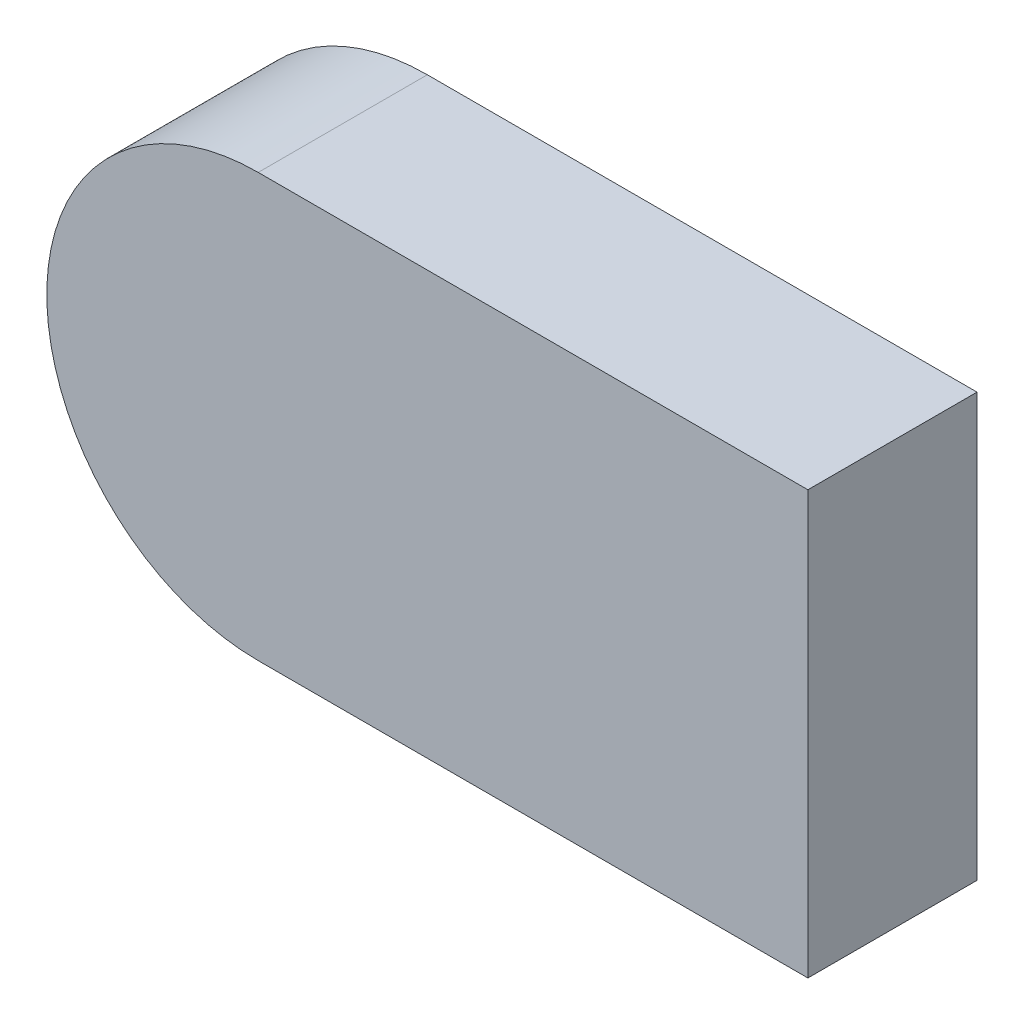
ISO-10303-21;
HEADER;
FILE_DESCRIPTION(('STEP AP214'),'2;1');
FILE_NAME('part.step','',(''),(''),'','','');
FILE_SCHEMA(('AUTOMOTIVE_DESIGN { 1 0 10303 214 1 1 1 1 }'));
ENDSEC;
DATA;
#1=APPLICATION_CONTEXT('core data for automotive mechanical design processes');
#2=APPLICATION_PROTOCOL_DEFINITION('international standard','automotive_design',2000,#1);
#3=PRODUCT_CONTEXT('',#1,'mechanical');
#4=PRODUCT('Part','Part','',(#3));
#5=PRODUCT_RELATED_PRODUCT_CATEGORY('part','',(#4));
#6=PRODUCT_DEFINITION_FORMATION('','',#4);
#7=PRODUCT_DEFINITION_CONTEXT('part definition',#1,'design');
#8=PRODUCT_DEFINITION('design','',#6,#7);
#9=PRODUCT_DEFINITION_SHAPE('','',#8);
#10=(LENGTH_UNIT() NAMED_UNIT(*) SI_UNIT(.MILLI.,.METRE.));
#11=(NAMED_UNIT(*) PLANE_ANGLE_UNIT() SI_UNIT($,.RADIAN.));
#12=(NAMED_UNIT(*) SI_UNIT($,.STERADIAN.) SOLID_ANGLE_UNIT());
#13=UNCERTAINTY_MEASURE_WITH_UNIT(LENGTH_MEASURE(1.E-05),#10,'distance_accuracy_value','');
#14=(GEOMETRIC_REPRESENTATION_CONTEXT(3) GLOBAL_UNCERTAINTY_ASSIGNED_CONTEXT((#13)) GLOBAL_UNIT_ASSIGNED_CONTEXT((#10,
#11,#12)) REPRESENTATION_CONTEXT('',''));
#15=CARTESIAN_POINT('',(0.,0.,0.));
#16=DIRECTION('',(0.,0.,1.));
#17=DIRECTION('',(1.,0.,0.));
#18=AXIS2_PLACEMENT_3D('',#15,#16,#17);
#19=CARTESIAN_POINT('',(2.05,0.125,0.));
#20=DIRECTION('',(0.,-1.,0.));
#21=DIRECTION('',(-1.,0.,0.));
#22=AXIS2_PLACEMENT_3D('',#19,#20,#21);
#23=PLANE('',#22);
#24=DIRECTION('',(0.,0.,1.));
#25=VECTOR('',#24,1.);
#26=CARTESIAN_POINT('',(2.05,0.125,0.));
#27=LINE('',#26,#25);
#28=CARTESIAN_POINT('',(2.05,0.125,0.));
#29=VERTEX_POINT('',#28);
#30=CARTESIAN_POINT('',(2.05,0.125,0.1));
#31=VERTEX_POINT('',#30);
#32=EDGE_CURVE('E11',#29,#31,#27,.T.);
#33=ORIENTED_EDGE('',*,*,#32,.T.);
#34=DIRECTION('',(-1.,0.,0.));
#35=VECTOR('',#34,1.);
#36=CARTESIAN_POINT('',(2.05,0.125,0.1));
#37=LINE('',#36,#35);
#38=CARTESIAN_POINT('',(1.725,0.125,0.1));
#39=VERTEX_POINT('',#38);
#40=EDGE_CURVE('E24',#31,#39,#37,.T.);
#41=ORIENTED_EDGE('',*,*,#40,.T.);
#42=DIRECTION('',(0.,0.,1.));
#43=VECTOR('',#42,1.);
#44=CARTESIAN_POINT('',(1.725,0.125,0.));
#45=LINE('',#44,#43);
#46=CARTESIAN_POINT('',(1.725,0.125,0.));
#47=VERTEX_POINT('',#46);
#48=EDGE_CURVE('E86',#47,#39,#45,.T.);
#49=ORIENTED_EDGE('',*,*,#48,.F.);
#50=DIRECTION('',(-1.,0.,0.));
#51=VECTOR('',#50,1.);
#52=CARTESIAN_POINT('',(2.05,0.125,0.));
#53=LINE('',#52,#51);
#54=EDGE_CURVE('E83',#29,#47,#53,.T.);
#55=ORIENTED_EDGE('',*,*,#54,.F.);
#56=EDGE_LOOP('',(#33,#41,#49,#55));
#57=FACE_BOUND('',#56,.T.);
#58=ADVANCED_FACE('F17',(#57),#23,.T.);
#59=CARTESIAN_POINT('',(1.725,0.25,0.));
#60=DIRECTION('',(0.,0.,-1.));
#61=DIRECTION('',(1.,0.,0.));
#62=AXIS2_PLACEMENT_3D('',#59,#60,#61);
#63=CYLINDRICAL_SURFACE('',#62,0.125);
#64=CARTESIAN_POINT('',(1.725,0.25,0.));
#65=DIRECTION('',(0.,0.,1.));
#66=DIRECTION('',(1.,0.,0.));
#67=AXIS2_PLACEMENT_3D('',#64,#65,#66);
#68=CIRCLE('',#67,0.125);
#69=CARTESIAN_POINT('',(1.725,0.375,0.));
#70=VERTEX_POINT('',#69);
#71=EDGE_CURVE('E80',#70,#47,#68,.T.);
#72=ORIENTED_EDGE('',*,*,#71,.T.);
#73=ORIENTED_EDGE('',*,*,#48,.T.);
#74=CARTESIAN_POINT('',(1.725,0.25,0.1));
#75=DIRECTION('',(0.,0.,1.));
#76=DIRECTION('',(1.,0.,0.));
#77=AXIS2_PLACEMENT_3D('',#74,#75,#76);
#78=CIRCLE('',#77,0.125);
#79=CARTESIAN_POINT('',(1.725,0.375,0.1));
#80=VERTEX_POINT('',#79);
#81=EDGE_CURVE('E78',#80,#39,#78,.T.);
#82=ORIENTED_EDGE('',*,*,#81,.F.);
#83=DIRECTION('',(0.,0.,1.));
#84=VECTOR('',#83,1.);
#85=CARTESIAN_POINT('',(1.725,0.375,0.));
#86=LINE('',#85,#84);
#87=EDGE_CURVE('E67',#70,#80,#86,.T.);
#88=ORIENTED_EDGE('',*,*,#87,.F.);
#89=EDGE_LOOP('',(#72,#73,#82,#88));
#90=FACE_BOUND('',#89,.T.);
#91=ADVANCED_FACE('F89',(#90),#63,.T.);
#92=CARTESIAN_POINT('',(2.05,0.375,0.));
#93=DIRECTION('',(0.,-1.,0.));
#94=DIRECTION('',(-1.,0.,0.));
#95=AXIS2_PLACEMENT_3D('',#92,#93,#94);
#96=PLANE('',#95);
#97=DIRECTION('',(-1.,0.,0.));
#98=VECTOR('',#97,1.);
#99=CARTESIAN_POINT('',(2.05,0.375,0.));
#100=LINE('',#99,#98);
#101=CARTESIAN_POINT('',(2.05,0.375,0.));
#102=VERTEX_POINT('',#101);
#103=EDGE_CURVE('E70',#102,#70,#100,.T.);
#104=ORIENTED_EDGE('',*,*,#103,.T.);
#105=ORIENTED_EDGE('',*,*,#87,.T.);
#106=DIRECTION('',(-1.,0.,0.));
#107=VECTOR('',#106,1.);
#108=CARTESIAN_POINT('',(2.05,0.375,0.1));
#109=LINE('',#108,#107);
#110=CARTESIAN_POINT('',(2.05,0.375,0.1));
#111=VERTEX_POINT('',#110);
#112=EDGE_CURVE('E61',#111,#80,#109,.T.);
#113=ORIENTED_EDGE('',*,*,#112,.F.);
#114=DIRECTION('',(0.,0.,1.));
#115=VECTOR('',#114,1.);
#116=CARTESIAN_POINT('',(2.05,0.375,0.));
#117=LINE('',#116,#115);
#118=EDGE_CURVE('E51',#102,#111,#117,.T.);
#119=ORIENTED_EDGE('',*,*,#118,.F.);
#120=EDGE_LOOP('',(#104,#105,#113,#119));
#121=FACE_BOUND('',#120,.T.);
#122=ADVANCED_FACE('F65',(#121),#96,.F.);
#123=CARTESIAN_POINT('',(2.05,0.125,0.));
#124=DIRECTION('',(-1.,0.,0.));
#125=DIRECTION('',(0.,1.,0.));
#126=AXIS2_PLACEMENT_3D('',#123,#124,#125);
#127=PLANE('',#126);
#128=DIRECTION('',(0.,1.,0.));
#129=VECTOR('',#128,1.);
#130=CARTESIAN_POINT('',(2.05,0.125,0.));
#131=LINE('',#130,#129);
#132=EDGE_CURVE('E57',#29,#102,#131,.T.);
#133=ORIENTED_EDGE('',*,*,#132,.T.);
#134=ORIENTED_EDGE('',*,*,#118,.T.);
#135=DIRECTION('',(0.,1.,0.));
#136=VECTOR('',#135,1.);
#137=CARTESIAN_POINT('',(2.05,0.125,0.1));
#138=LINE('',#137,#136);
#139=EDGE_CURVE('E55',#31,#111,#138,.T.);
#140=ORIENTED_EDGE('',*,*,#139,.F.);
#141=ORIENTED_EDGE('',*,*,#32,.F.);
#142=EDGE_LOOP('',(#133,#134,#140,#141));
#143=FACE_BOUND('',#142,.T.);
#144=ADVANCED_FACE('F53',(#143),#127,.F.);
#145=CARTESIAN_POINT('',(1.850342514613,0.25,0.));
#146=DIRECTION('',(0.,0.,-1.));
#147=DIRECTION('',(-1.,0.,0.));
#148=AXIS2_PLACEMENT_3D('',#145,#146,#147);
#149=PLANE('',#148);
#150=ORIENTED_EDGE('',*,*,#54,.T.);
#151=ORIENTED_EDGE('',*,*,#71,.F.);
#152=ORIENTED_EDGE('',*,*,#103,.F.);
#153=ORIENTED_EDGE('',*,*,#132,.F.);
#154=EDGE_LOOP('',(#150,#151,#152,#153));
#155=FACE_BOUND('',#154,.T.);
#156=ADVANCED_FACE('F91',(#155),#149,.T.);
#157=CARTESIAN_POINT('',(1.850342514613,0.25,0.1));
#158=DIRECTION('',(0.,0.,-1.));
#159=DIRECTION('',(-1.,0.,0.));
#160=AXIS2_PLACEMENT_3D('',#157,#158,#159);
#161=PLANE('',#160);
#162=ORIENTED_EDGE('',*,*,#139,.T.);
#163=ORIENTED_EDGE('',*,*,#112,.T.);
#164=ORIENTED_EDGE('',*,*,#81,.T.);
#165=ORIENTED_EDGE('',*,*,#40,.F.);
#166=EDGE_LOOP('',(#162,#163,#164,#165));
#167=FACE_BOUND('',#166,.T.);
#168=ADVANCED_FACE('F72',(#167),#161,.F.);
#169=CLOSED_SHELL('',(#58,#91,#122,#144,#156,#168));
#170=MANIFOLD_SOLID_BREP('B1',#169);
#171=ADVANCED_BREP_SHAPE_REPRESENTATION('',(#18,#170),#14);
#172=SHAPE_DEFINITION_REPRESENTATION(#9,#171);
ENDSEC;
END-ISO-10303-21;
